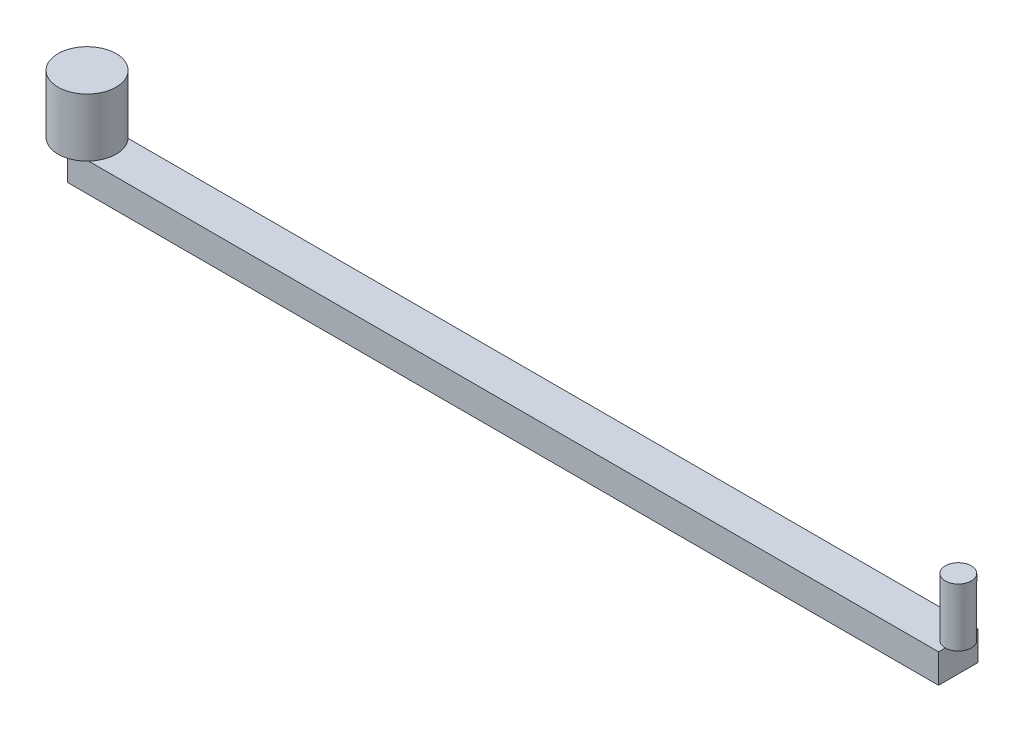
ISO-10303-21;
HEADER;
FILE_DESCRIPTION(('STEP AP214'),'2;1');
FILE_NAME('part.step','',(''),(''),'','','');
FILE_SCHEMA(('AUTOMOTIVE_DESIGN { 1 0 10303 214 1 1 1 1 }'));
ENDSEC;
DATA;
#1=APPLICATION_CONTEXT('core data for automotive mechanical design processes');
#2=APPLICATION_PROTOCOL_DEFINITION('international standard','automotive_design',2000,#1);
#3=PRODUCT_CONTEXT('',#1,'mechanical');
#4=PRODUCT('Part','Part','',(#3));
#5=PRODUCT_RELATED_PRODUCT_CATEGORY('part','',(#4));
#6=PRODUCT_DEFINITION_FORMATION('','',#4);
#7=PRODUCT_DEFINITION_CONTEXT('part definition',#1,'design');
#8=PRODUCT_DEFINITION('design','',#6,#7);
#9=PRODUCT_DEFINITION_SHAPE('','',#8);
#10=(LENGTH_UNIT() NAMED_UNIT(*) SI_UNIT(.MILLI.,.METRE.));
#11=(NAMED_UNIT(*) PLANE_ANGLE_UNIT() SI_UNIT($,.RADIAN.));
#12=(NAMED_UNIT(*) SI_UNIT($,.STERADIAN.) SOLID_ANGLE_UNIT());
#13=UNCERTAINTY_MEASURE_WITH_UNIT(LENGTH_MEASURE(1.E-05),#10,'distance_accuracy_value','');
#14=(GEOMETRIC_REPRESENTATION_CONTEXT(3) GLOBAL_UNCERTAINTY_ASSIGNED_CONTEXT((#13)) GLOBAL_UNIT_ASSIGNED_CONTEXT((#10,
#11,#12)) REPRESENTATION_CONTEXT('',''));
#15=CARTESIAN_POINT('',(0.,0.,0.));
#16=DIRECTION('',(0.,0.,1.));
#17=DIRECTION('',(1.,0.,0.));
#18=AXIS2_PLACEMENT_3D('',#15,#16,#17);
#19=CARTESIAN_POINT('',(38.1,2.54,1.72526236451499));
#20=DIRECTION('',(-1.,0.,0.));
#21=DIRECTION('',(0.,0.,1.));
#22=AXIS2_PLACEMENT_3D('',#19,#20,#21);
#23=PLANE('',#22);
#24=DIRECTION('',(0.,0.,-1.));
#25=VECTOR('',#24,1.);
#26=CARTESIAN_POINT('',(38.1,0.,1.72526236451499));
#27=LINE('',#26,#25);
#28=CARTESIAN_POINT('',(38.1,0.,1.72526236451499));
#29=VERTEX_POINT('',#28);
#30=CARTESIAN_POINT('',(38.1,0.,-1.72526236451499));
#31=VERTEX_POINT('',#30);
#32=EDGE_CURVE('E128',#29,#31,#27,.T.);
#33=ORIENTED_EDGE('',*,*,#32,.T.);
#34=DIRECTION('',(0.,-1.,0.));
#35=VECTOR('',#34,1.);
#36=CARTESIAN_POINT('',(38.1,2.54,-1.72526236451499));
#37=LINE('',#36,#35);
#38=CARTESIAN_POINT('',(38.1,2.54,-1.72526236451499));
#39=VERTEX_POINT('',#38);
#40=EDGE_CURVE('E53',#39,#31,#37,.T.);
#41=ORIENTED_EDGE('',*,*,#40,.F.);
#42=DIRECTION('',(0.,0.,-1.));
#43=VECTOR('',#42,1.);
#44=CARTESIAN_POINT('',(38.1,2.54,1.72526236451499));
#45=LINE('',#44,#43);
#46=CARTESIAN_POINT('',(38.1,2.54,-1.143));
#47=VERTEX_POINT('',#46);
#48=EDGE_CURVE('E104',#47,#39,#45,.T.);
#49=ORIENTED_EDGE('',*,*,#48,.F.);
#50=CARTESIAN_POINT('',(38.1,2.54,1.143));
#51=VERTEX_POINT('',#50);
#52=EDGE_CURVE('E102',#51,#47,#45,.T.);
#53=ORIENTED_EDGE('',*,*,#52,.F.);
#54=CARTESIAN_POINT('',(38.1,2.54,1.72526236451499));
#55=VERTEX_POINT('',#54);
#56=EDGE_CURVE('E93',#55,#51,#45,.T.);
#57=ORIENTED_EDGE('',*,*,#56,.F.);
#58=DIRECTION('',(0.,-1.,0.));
#59=VECTOR('',#58,1.);
#60=CARTESIAN_POINT('',(38.1,2.54,1.72526236451499));
#61=LINE('',#60,#59);
#62=EDGE_CURVE('E142',#55,#29,#61,.T.);
#63=ORIENTED_EDGE('',*,*,#62,.T.);
#64=EDGE_LOOP('',(#33,#41,#49,#53,#57,#63));
#65=FACE_BOUND('',#64,.T.);
#66=ADVANCED_FACE('F45',(#65),#23,.F.);
#67=CARTESIAN_POINT('',(-38.1,2.54,-1.72526236451499));
#68=DIRECTION('',(0.,0.,1.));
#69=DIRECTION('',(1.,0.,0.));
#70=AXIS2_PLACEMENT_3D('',#67,#68,#69);
#71=PLANE('',#70);
#72=DIRECTION('',(-1.,0.,0.));
#73=VECTOR('',#72,1.);
#74=CARTESIAN_POINT('',(-38.1,0.,-1.72526236451499));
#75=LINE('',#74,#73);
#76=CARTESIAN_POINT('',(-38.1,0.,-1.72526236451499));
#77=VERTEX_POINT('',#76);
#78=EDGE_CURVE('E145',#31,#77,#75,.T.);
#79=ORIENTED_EDGE('',*,*,#78,.T.);
#80=DIRECTION('',(0.,-1.,0.));
#81=VECTOR('',#80,1.);
#82=CARTESIAN_POINT('',(-38.1,2.54,-1.72526236451499));
#83=LINE('',#82,#81);
#84=CARTESIAN_POINT('',(-38.1,2.54,-1.72526236451499));
#85=VERTEX_POINT('',#84);
#86=EDGE_CURVE('E160',#85,#77,#83,.T.);
#87=ORIENTED_EDGE('',*,*,#86,.F.);
#88=DIRECTION('',(-1.,0.,0.));
#89=VECTOR('',#88,1.);
#90=CARTESIAN_POINT('',(-38.1,2.54,-1.72526236451499));
#91=LINE('',#90,#89);
#92=CARTESIAN_POINT('',(-36.2358460971293,2.54,-1.72526236451499));
#93=VERTEX_POINT('',#92);
#94=EDGE_CURVE('E101',#93,#85,#91,.T.);
#95=ORIENTED_EDGE('',*,*,#94,.F.);
#96=EDGE_CURVE('E131',#39,#93,#91,.T.);
#97=ORIENTED_EDGE('',*,*,#96,.F.);
#98=ORIENTED_EDGE('',*,*,#40,.T.);
#99=EDGE_LOOP('',(#79,#87,#95,#97,#98));
#100=FACE_BOUND('',#99,.T.);
#101=ADVANCED_FACE('F167',(#100),#71,.F.);
#102=CARTESIAN_POINT('',(-38.1,2.54,1.72526236451499));
#103=DIRECTION('',(1.,0.,0.));
#104=DIRECTION('',(0.,0.,-1.));
#105=AXIS2_PLACEMENT_3D('',#102,#103,#104);
#106=PLANE('',#105);
#107=DIRECTION('',(0.,0.,1.));
#108=VECTOR('',#107,1.);
#109=CARTESIAN_POINT('',(-38.1,0.,1.72526236451499));
#110=LINE('',#109,#108);
#111=CARTESIAN_POINT('',(-38.1,0.,1.72526236451499));
#112=VERTEX_POINT('',#111);
#113=EDGE_CURVE('E148',#77,#112,#110,.T.);
#114=ORIENTED_EDGE('',*,*,#113,.T.);
#115=DIRECTION('',(0.,-1.,0.));
#116=VECTOR('',#115,1.);
#117=CARTESIAN_POINT('',(-38.1,2.54,1.72526236451499));
#118=LINE('',#117,#116);
#119=CARTESIAN_POINT('',(-38.1,2.54,1.72526236451499));
#120=VERTEX_POINT('',#119);
#121=EDGE_CURVE('E156',#120,#112,#118,.T.);
#122=ORIENTED_EDGE('',*,*,#121,.F.);
#123=DIRECTION('',(0.,0.,1.));
#124=VECTOR('',#123,1.);
#125=CARTESIAN_POINT('',(-38.1,2.54,1.72526236451499));
#126=LINE('',#125,#124);
#127=EDGE_CURVE('E134',#85,#120,#126,.T.);
#128=ORIENTED_EDGE('',*,*,#127,.F.);
#129=ORIENTED_EDGE('',*,*,#86,.T.);
#130=EDGE_LOOP('',(#114,#122,#128,#129));
#131=FACE_BOUND('',#130,.T.);
#132=ADVANCED_FACE('F175',(#131),#106,.F.);
#133=CARTESIAN_POINT('',(-38.1,2.54,1.72526236451499));
#134=DIRECTION('',(0.,0.,-1.));
#135=DIRECTION('',(-1.,0.,0.));
#136=AXIS2_PLACEMENT_3D('',#133,#134,#135);
#137=PLANE('',#136);
#138=DIRECTION('',(1.,0.,0.));
#139=VECTOR('',#138,1.);
#140=CARTESIAN_POINT('',(-38.1,0.,1.72526236451499));
#141=LINE('',#140,#139);
#142=EDGE_CURVE('E151',#112,#29,#141,.T.);
#143=ORIENTED_EDGE('',*,*,#142,.T.);
#144=ORIENTED_EDGE('',*,*,#62,.F.);
#145=DIRECTION('',(1.,0.,0.));
#146=VECTOR('',#145,1.);
#147=CARTESIAN_POINT('',(-38.1,2.54,1.72526236451499));
#148=LINE('',#147,#146);
#149=CARTESIAN_POINT('',(-36.2358460971293,2.54,1.72526236451499));
#150=VERTEX_POINT('',#149);
#151=EDGE_CURVE('E96',#150,#55,#148,.T.);
#152=ORIENTED_EDGE('',*,*,#151,.F.);
#153=EDGE_CURVE('E138',#120,#150,#148,.T.);
#154=ORIENTED_EDGE('',*,*,#153,.F.);
#155=ORIENTED_EDGE('',*,*,#121,.T.);
#156=EDGE_LOOP('',(#143,#144,#152,#154,#155));
#157=FACE_BOUND('',#156,.T.);
#158=ADVANCED_FACE('F179',(#157),#137,.F.);
#159=CARTESIAN_POINT('',(0.,2.54,0.));
#160=DIRECTION('',(0.,-1.,0.));
#161=DIRECTION('',(0.,0.,-1.));
#162=AXIS2_PLACEMENT_3D('',#159,#160,#161);
#163=PLANE('',#162);
#164=CARTESIAN_POINT('',(38.1,2.54,0.));
#165=DIRECTION('',(0.,-1.,0.));
#166=DIRECTION('',(0.,0.,-1.));
#167=AXIS2_PLACEMENT_3D('',#164,#165,#166);
#168=CIRCLE('',#167,1.143);
#169=EDGE_CURVE('E11',#47,#51,#168,.F.);
#170=ORIENTED_EDGE('',*,*,#169,.F.);
#171=ORIENTED_EDGE('',*,*,#48,.T.);
#172=ORIENTED_EDGE('',*,*,#96,.T.);
#173=CARTESIAN_POINT('',(-38.1,2.54,0.));
#174=DIRECTION('',(0.,1.,0.));
#175=DIRECTION('',(0.,0.,1.));
#176=AXIS2_PLACEMENT_3D('',#173,#174,#175);
#177=CIRCLE('',#176,2.54);
#178=EDGE_CURVE('E65',#150,#93,#177,.T.);
#179=ORIENTED_EDGE('',*,*,#178,.F.);
#180=ORIENTED_EDGE('',*,*,#151,.T.);
#181=ORIENTED_EDGE('',*,*,#56,.T.);
#182=EDGE_LOOP('',(#170,#171,#172,#179,#180,#181));
#183=FACE_BOUND('',#182,.T.);
#184=ADVANCED_FACE('F95',(#183),#163,.F.);
#185=CARTESIAN_POINT('',(0.,0.,0.));
#186=DIRECTION('',(0.,-1.,0.));
#187=DIRECTION('',(0.,0.,-1.));
#188=AXIS2_PLACEMENT_3D('',#185,#186,#187);
#189=PLANE('',#188);
#190=ORIENTED_EDGE('',*,*,#32,.F.);
#191=ORIENTED_EDGE('',*,*,#142,.F.);
#192=ORIENTED_EDGE('',*,*,#113,.F.);
#193=ORIENTED_EDGE('',*,*,#78,.F.);
#194=EDGE_LOOP('',(#190,#191,#192,#193));
#195=FACE_BOUND('',#194,.T.);
#196=ADVANCED_FACE('F172',(#195),#189,.T.);
#197=CARTESIAN_POINT('',(-38.1,2.54,0.));
#198=DIRECTION('',(0.,1.,0.));
#199=DIRECTION('',(0.,0.,1.));
#200=AXIS2_PLACEMENT_3D('',#197,#198,#199);
#201=PLANE('',#200);
#202=EDGE_CURVE('E121',#93,#150,#177,.T.);
#203=ORIENTED_EDGE('',*,*,#202,.F.);
#204=ORIENTED_EDGE('',*,*,#94,.T.);
#205=ORIENTED_EDGE('',*,*,#127,.T.);
#206=ORIENTED_EDGE('',*,*,#153,.T.);
#207=EDGE_LOOP('',(#203,#204,#205,#206));
#208=FACE_BOUND('',#207,.T.);
#209=ADVANCED_FACE('F184',(#208),#201,.F.);
#210=CARTESIAN_POINT('',(-38.1,7.62,0.));
#211=DIRECTION('',(0.,-1.,0.));
#212=DIRECTION('',(0.,0.,-1.));
#213=AXIS2_PLACEMENT_3D('',#210,#211,#212);
#214=CYLINDRICAL_SURFACE('',#213,2.54);
#215=CARTESIAN_POINT('',(-38.1,7.62,0.));
#216=DIRECTION('',(0.,1.,0.));
#217=DIRECTION('',(0.,0.,1.));
#218=AXIS2_PLACEMENT_3D('',#215,#216,#217);
#219=CIRCLE('',#218,2.54);
#220=CARTESIAN_POINT('',(-38.1,7.62,2.54));
#221=VERTEX_POINT('',#220);
#222=EDGE_CURVE('E124',#221,#221,#219,.T.);
#223=ORIENTED_EDGE('',*,*,#222,.F.);
#224=EDGE_LOOP('',(#223));
#225=FACE_BOUND('',#224,.T.);
#226=ORIENTED_EDGE('',*,*,#178,.T.);
#227=ORIENTED_EDGE('',*,*,#202,.T.);
#228=EDGE_LOOP('',(#226,#227));
#229=FACE_BOUND('',#228,.T.);
#230=ADVANCED_FACE('F189',(#225,#229),#214,.T.);
#231=CARTESIAN_POINT('',(-38.1,7.62,0.));
#232=DIRECTION('',(0.,1.,0.));
#233=DIRECTION('',(0.,0.,1.));
#234=AXIS2_PLACEMENT_3D('',#231,#232,#233);
#235=PLANE('',#234);
#236=ORIENTED_EDGE('',*,*,#222,.T.);
#237=EDGE_LOOP('',(#236));
#238=FACE_BOUND('',#237,.T.);
#239=ADVANCED_FACE('F191',(#238),#235,.T.);
#240=CARTESIAN_POINT('',(38.1,2.54,0.));
#241=DIRECTION('',(0.,1.,0.));
#242=DIRECTION('',(0.,0.,1.));
#243=AXIS2_PLACEMENT_3D('',#240,#241,#242);
#244=PLANE('',#243);
#245=CARTESIAN_POINT('',(38.1,2.54,0.));
#246=DIRECTION('',(0.,1.,0.));
#247=DIRECTION('',(0.,0.,1.));
#248=AXIS2_PLACEMENT_3D('',#245,#246,#247);
#249=CIRCLE('',#248,1.143);
#250=EDGE_CURVE('E114',#51,#47,#249,.T.);
#251=ORIENTED_EDGE('',*,*,#250,.F.);
#252=ORIENTED_EDGE('',*,*,#52,.T.);
#253=EDGE_LOOP('',(#251,#252));
#254=FACE_BOUND('',#253,.T.);
#255=ADVANCED_FACE('F115',(#254),#244,.F.);
#256=CARTESIAN_POINT('',(38.1,7.62,0.));
#257=DIRECTION('',(0.,-1.,0.));
#258=DIRECTION('',(0.,0.,-1.));
#259=AXIS2_PLACEMENT_3D('',#256,#257,#258);
#260=CYLINDRICAL_SURFACE('',#259,1.143);
#261=CARTESIAN_POINT('',(38.1,7.62,0.));
#262=DIRECTION('',(0.,1.,0.));
#263=DIRECTION('',(0.,0.,1.));
#264=AXIS2_PLACEMENT_3D('',#261,#262,#263);
#265=CIRCLE('',#264,1.143);
#266=CARTESIAN_POINT('',(38.1,7.62,1.143));
#267=VERTEX_POINT('',#266);
#268=EDGE_CURVE('E117',#267,#267,#265,.T.);
#269=ORIENTED_EDGE('',*,*,#268,.F.);
#270=EDGE_LOOP('',(#269));
#271=FACE_BOUND('',#270,.T.);
#272=ORIENTED_EDGE('',*,*,#250,.T.);
#273=ORIENTED_EDGE('',*,*,#169,.T.);
#274=EDGE_LOOP('',(#272,#273));
#275=FACE_BOUND('',#274,.T.);
#276=ADVANCED_FACE('F113',(#271,#275),#260,.T.);
#277=CARTESIAN_POINT('',(38.1,7.62,0.));
#278=DIRECTION('',(0.,1.,0.));
#279=DIRECTION('',(0.,0.,1.));
#280=AXIS2_PLACEMENT_3D('',#277,#278,#279);
#281=PLANE('',#280);
#282=ORIENTED_EDGE('',*,*,#268,.T.);
#283=EDGE_LOOP('',(#282));
#284=FACE_BOUND('',#283,.T.);
#285=ADVANCED_FACE('F235',(#284),#281,.T.);
#286=CLOSED_SHELL('',(#66,#101,#132,#158,#184,#196,#209,#230,#239,#255,#276,#285));
#287=MANIFOLD_SOLID_BREP('B2',#286);
#288=ADVANCED_BREP_SHAPE_REPRESENTATION('',(#18,#287),#14);
#289=SHAPE_DEFINITION_REPRESENTATION(#9,#288);
ENDSEC;
END-ISO-10303-21;
